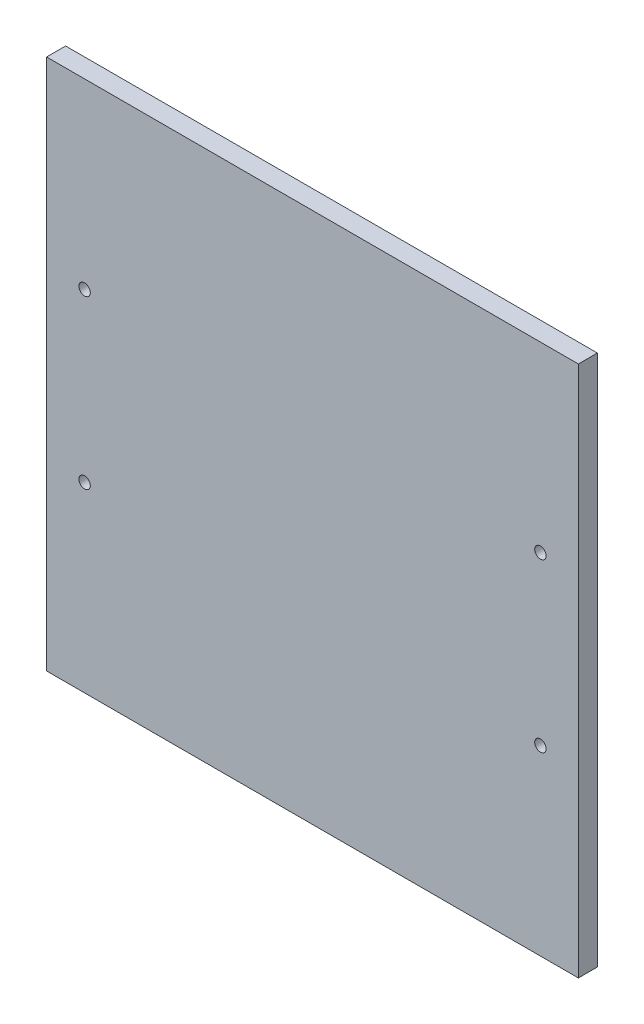
ISO-10303-21;
HEADER;
FILE_DESCRIPTION(('STEP AP214'),'2;1');
FILE_NAME('part.step','',(''),(''),'','','');
FILE_SCHEMA(('AUTOMOTIVE_DESIGN { 1 0 10303 214 1 1 1 1 }'));
ENDSEC;
DATA;
#1=APPLICATION_CONTEXT('core data for automotive mechanical design processes');
#2=APPLICATION_PROTOCOL_DEFINITION('international standard','automotive_design',2000,#1);
#3=PRODUCT_CONTEXT('',#1,'mechanical');
#4=PRODUCT('Part','Part','',(#3));
#5=PRODUCT_RELATED_PRODUCT_CATEGORY('part','',(#4));
#6=PRODUCT_DEFINITION_FORMATION('','',#4);
#7=PRODUCT_DEFINITION_CONTEXT('part definition',#1,'design');
#8=PRODUCT_DEFINITION('design','',#6,#7);
#9=PRODUCT_DEFINITION_SHAPE('','',#8);
#10=(LENGTH_UNIT() NAMED_UNIT(*) SI_UNIT(.MILLI.,.METRE.));
#11=(NAMED_UNIT(*) PLANE_ANGLE_UNIT() SI_UNIT($,.RADIAN.));
#12=(NAMED_UNIT(*) SI_UNIT($,.STERADIAN.) SOLID_ANGLE_UNIT());
#13=UNCERTAINTY_MEASURE_WITH_UNIT(LENGTH_MEASURE(1.E-05),#10,'distance_accuracy_value','');
#14=(GEOMETRIC_REPRESENTATION_CONTEXT(3) GLOBAL_UNCERTAINTY_ASSIGNED_CONTEXT((#13)) GLOBAL_UNIT_ASSIGNED_CONTEXT((#10,
#11,#12)) REPRESENTATION_CONTEXT('',''));
#15=CARTESIAN_POINT('',(0.,0.,0.));
#16=DIRECTION('',(0.,0.,1.));
#17=DIRECTION('',(1.,0.,0.));
#18=AXIS2_PLACEMENT_3D('',#15,#16,#17);
#19=CARTESIAN_POINT('',(0.,0.,5.));
#20=DIRECTION('',(1.,0.,0.));
#21=DIRECTION('',(0.,0.,-1.));
#22=AXIS2_PLACEMENT_3D('',#19,#20,#21);
#23=PLANE('',#22);
#24=DIRECTION('',(0.,-1.,0.));
#25=VECTOR('',#24,1.);
#26=CARTESIAN_POINT('',(0.,0.,0.));
#27=LINE('',#26,#25);
#28=CARTESIAN_POINT('',(0.,140.,0.));
#29=VERTEX_POINT('',#28);
#30=CARTESIAN_POINT('',(0.,0.,0.));
#31=VERTEX_POINT('',#30);
#32=EDGE_CURVE('E94',#29,#31,#27,.T.);
#33=ORIENTED_EDGE('',*,*,#32,.T.);
#34=DIRECTION('',(0.,0.,-1.));
#35=VECTOR('',#34,1.);
#36=CARTESIAN_POINT('',(0.,0.,5.));
#37=LINE('',#36,#35);
#38=CARTESIAN_POINT('',(0.,0.,5.));
#39=VERTEX_POINT('',#38);
#40=EDGE_CURVE('E11',#39,#31,#37,.T.);
#41=ORIENTED_EDGE('',*,*,#40,.F.);
#42=DIRECTION('',(0.,-1.,0.));
#43=VECTOR('',#42,1.);
#44=CARTESIAN_POINT('',(0.,0.,5.));
#45=LINE('',#44,#43);
#46=CARTESIAN_POINT('',(0.,140.,5.));
#47=VERTEX_POINT('',#46);
#48=EDGE_CURVE('E82',#47,#39,#45,.T.);
#49=ORIENTED_EDGE('',*,*,#48,.F.);
#50=DIRECTION('',(0.,0.,-1.));
#51=VECTOR('',#50,1.);
#52=CARTESIAN_POINT('',(0.,140.,5.));
#53=LINE('',#52,#51);
#54=EDGE_CURVE('E90',#47,#29,#53,.T.);
#55=ORIENTED_EDGE('',*,*,#54,.T.);
#56=EDGE_LOOP('',(#33,#41,#49,#55));
#57=FACE_BOUND('',#56,.T.);
#58=ADVANCED_FACE('F31',(#57),#23,.F.);
#59=CARTESIAN_POINT('',(0.,0.,5.));
#60=DIRECTION('',(0.,1.,0.));
#61=DIRECTION('',(-1.,0.,0.));
#62=AXIS2_PLACEMENT_3D('',#59,#60,#61);
#63=PLANE('',#62);
#64=DIRECTION('',(1.,0.,0.));
#65=VECTOR('',#64,1.);
#66=CARTESIAN_POINT('',(0.,0.,0.));
#67=LINE('',#66,#65);
#68=CARTESIAN_POINT('',(140.,0.,0.));
#69=VERTEX_POINT('',#68);
#70=EDGE_CURVE('E86',#31,#69,#67,.T.);
#71=ORIENTED_EDGE('',*,*,#70,.T.);
#72=DIRECTION('',(0.,0.,-1.));
#73=VECTOR('',#72,1.);
#74=CARTESIAN_POINT('',(140.,0.,5.));
#75=LINE('',#74,#73);
#76=CARTESIAN_POINT('',(140.,0.,5.));
#77=VERTEX_POINT('',#76);
#78=EDGE_CURVE('E39',#77,#69,#75,.T.);
#79=ORIENTED_EDGE('',*,*,#78,.F.);
#80=DIRECTION('',(1.,0.,0.));
#81=VECTOR('',#80,1.);
#82=CARTESIAN_POINT('',(0.,0.,5.));
#83=LINE('',#82,#81);
#84=EDGE_CURVE('E77',#39,#77,#83,.T.);
#85=ORIENTED_EDGE('',*,*,#84,.F.);
#86=ORIENTED_EDGE('',*,*,#40,.T.);
#87=EDGE_LOOP('',(#71,#79,#85,#86));
#88=FACE_BOUND('',#87,.T.);
#89=ADVANCED_FACE('F85',(#88),#63,.F.);
#90=CARTESIAN_POINT('',(140.,0.,5.));
#91=DIRECTION('',(-1.,0.,0.));
#92=DIRECTION('',(0.,-1.,0.));
#93=AXIS2_PLACEMENT_3D('',#90,#91,#92);
#94=PLANE('',#93);
#95=DIRECTION('',(0.,1.,0.));
#96=VECTOR('',#95,1.);
#97=CARTESIAN_POINT('',(140.,0.,0.));
#98=LINE('',#97,#96);
#99=CARTESIAN_POINT('',(140.,140.,0.));
#100=VERTEX_POINT('',#99);
#101=EDGE_CURVE('E64',#69,#100,#98,.T.);
#102=ORIENTED_EDGE('',*,*,#101,.T.);
#103=DIRECTION('',(0.,0.,-1.));
#104=VECTOR('',#103,1.);
#105=CARTESIAN_POINT('',(140.,140.,5.));
#106=LINE('',#105,#104);
#107=CARTESIAN_POINT('',(140.,140.,5.));
#108=VERTEX_POINT('',#107);
#109=EDGE_CURVE('E87',#108,#100,#106,.T.);
#110=ORIENTED_EDGE('',*,*,#109,.F.);
#111=DIRECTION('',(0.,1.,0.));
#112=VECTOR('',#111,1.);
#113=CARTESIAN_POINT('',(140.,0.,5.));
#114=LINE('',#113,#112);
#115=EDGE_CURVE('E80',#77,#108,#114,.T.);
#116=ORIENTED_EDGE('',*,*,#115,.F.);
#117=ORIENTED_EDGE('',*,*,#78,.T.);
#118=EDGE_LOOP('',(#102,#110,#116,#117));
#119=FACE_BOUND('',#118,.T.);
#120=ADVANCED_FACE('F88',(#119),#94,.F.);
#121=CARTESIAN_POINT('',(0.,140.,5.));
#122=DIRECTION('',(0.,-1.,0.));
#123=DIRECTION('',(0.,0.,-1.));
#124=AXIS2_PLACEMENT_3D('',#121,#122,#123);
#125=PLANE('',#124);
#126=DIRECTION('',(-1.,0.,0.));
#127=VECTOR('',#126,1.);
#128=CARTESIAN_POINT('',(0.,140.,0.));
#129=LINE('',#128,#127);
#130=EDGE_CURVE('E70',#100,#29,#129,.T.);
#131=ORIENTED_EDGE('',*,*,#130,.T.);
#132=ORIENTED_EDGE('',*,*,#54,.F.);
#133=DIRECTION('',(-1.,0.,0.));
#134=VECTOR('',#133,1.);
#135=CARTESIAN_POINT('',(0.,140.,5.));
#136=LINE('',#135,#134);
#137=EDGE_CURVE('E47',#108,#47,#136,.T.);
#138=ORIENTED_EDGE('',*,*,#137,.F.);
#139=ORIENTED_EDGE('',*,*,#109,.T.);
#140=EDGE_LOOP('',(#131,#132,#138,#139));
#141=FACE_BOUND('',#140,.T.);
#142=ADVANCED_FACE('F102',(#141),#125,.F.);
#143=CARTESIAN_POINT('',(0.,140.,5.));
#144=DIRECTION('',(0.,0.,-1.));
#145=DIRECTION('',(-1.,0.,0.));
#146=AXIS2_PLACEMENT_3D('',#143,#144,#145);
#147=PLANE('',#146);
#148=CARTESIAN_POINT('',(130.,92.,5.));
#149=DIRECTION('',(0.,0.,-1.));
#150=DIRECTION('',(-1.,0.,0.));
#151=AXIS2_PLACEMENT_3D('',#148,#149,#150);
#152=CIRCLE('',#151,1.5);
#153=CARTESIAN_POINT('',(128.5,92.,5.));
#154=VERTEX_POINT('',#153);
#155=EDGE_CURVE('E134',#154,#154,#152,.T.);
#156=ORIENTED_EDGE('',*,*,#155,.T.);
#157=EDGE_LOOP('',(#156));
#158=FACE_BOUND('',#157,.T.);
#159=CARTESIAN_POINT('',(130.,48.,5.));
#160=DIRECTION('',(0.,0.,-1.));
#161=DIRECTION('',(-1.,0.,0.));
#162=AXIS2_PLACEMENT_3D('',#159,#160,#161);
#163=CIRCLE('',#162,1.5);
#164=CARTESIAN_POINT('',(128.5,48.,5.));
#165=VERTEX_POINT('',#164);
#166=EDGE_CURVE('E125',#165,#165,#163,.T.);
#167=ORIENTED_EDGE('',*,*,#166,.T.);
#168=EDGE_LOOP('',(#167));
#169=FACE_BOUND('',#168,.T.);
#170=CARTESIAN_POINT('',(10.,92.,5.));
#171=DIRECTION('',(0.,0.,-1.));
#172=DIRECTION('',(-1.,0.,0.));
#173=AXIS2_PLACEMENT_3D('',#170,#171,#172);
#174=CIRCLE('',#173,1.5);
#175=CARTESIAN_POINT('',(8.50000000000005,92.,5.));
#176=VERTEX_POINT('',#175);
#177=EDGE_CURVE('E116',#176,#176,#174,.T.);
#178=ORIENTED_EDGE('',*,*,#177,.T.);
#179=EDGE_LOOP('',(#178));
#180=FACE_BOUND('',#179,.T.);
#181=CARTESIAN_POINT('',(10.,48.,5.));
#182=DIRECTION('',(0.,0.,-1.));
#183=DIRECTION('',(-1.,0.,0.));
#184=AXIS2_PLACEMENT_3D('',#181,#182,#183);
#185=CIRCLE('',#184,1.5);
#186=CARTESIAN_POINT('',(8.50000000000004,48.,5.));
#187=VERTEX_POINT('',#186);
#188=EDGE_CURVE('E97',#187,#187,#185,.T.);
#189=ORIENTED_EDGE('',*,*,#188,.T.);
#190=EDGE_LOOP('',(#189));
#191=FACE_BOUND('',#190,.T.);
#192=ORIENTED_EDGE('',*,*,#48,.T.);
#193=ORIENTED_EDGE('',*,*,#84,.T.);
#194=ORIENTED_EDGE('',*,*,#115,.T.);
#195=ORIENTED_EDGE('',*,*,#137,.T.);
#196=EDGE_LOOP('',(#192,#193,#194,#195));
#197=FACE_BOUND('',#196,.T.);
#198=ADVANCED_FACE('F78',(#158,#169,#180,#191,#197),#147,.F.);
#199=CARTESIAN_POINT('',(0.,140.,0.));
#200=DIRECTION('',(0.,0.,-1.));
#201=DIRECTION('',(-1.,0.,0.));
#202=AXIS2_PLACEMENT_3D('',#199,#200,#201);
#203=PLANE('',#202);
#204=CARTESIAN_POINT('',(130.,92.,0.));
#205=DIRECTION('',(0.,0.,-1.));
#206=DIRECTION('',(-1.,0.,0.));
#207=AXIS2_PLACEMENT_3D('',#204,#205,#206);
#208=CIRCLE('',#207,4.);
#209=CARTESIAN_POINT('',(126.,92.,0.));
#210=VERTEX_POINT('',#209);
#211=EDGE_CURVE('E140',#210,#210,#208,.T.);
#212=ORIENTED_EDGE('',*,*,#211,.F.);
#213=EDGE_LOOP('',(#212));
#214=FACE_BOUND('',#213,.T.);
#215=CARTESIAN_POINT('',(130.,48.,0.));
#216=DIRECTION('',(0.,0.,-1.));
#217=DIRECTION('',(-1.,0.,0.));
#218=AXIS2_PLACEMENT_3D('',#215,#216,#217);
#219=CIRCLE('',#218,4.);
#220=CARTESIAN_POINT('',(126.,48.,0.));
#221=VERTEX_POINT('',#220);
#222=EDGE_CURVE('E131',#221,#221,#219,.T.);
#223=ORIENTED_EDGE('',*,*,#222,.F.);
#224=EDGE_LOOP('',(#223));
#225=FACE_BOUND('',#224,.T.);
#226=CARTESIAN_POINT('',(10.,92.,0.));
#227=DIRECTION('',(0.,0.,-1.));
#228=DIRECTION('',(-1.,0.,0.));
#229=AXIS2_PLACEMENT_3D('',#226,#227,#228);
#230=CIRCLE('',#229,4.);
#231=CARTESIAN_POINT('',(6.00000000000005,92.,0.));
#232=VERTEX_POINT('',#231);
#233=EDGE_CURVE('E122',#232,#232,#230,.T.);
#234=ORIENTED_EDGE('',*,*,#233,.F.);
#235=EDGE_LOOP('',(#234));
#236=FACE_BOUND('',#235,.T.);
#237=CARTESIAN_POINT('',(10.,48.,0.));
#238=DIRECTION('',(0.,0.,-1.));
#239=DIRECTION('',(-1.,0.,0.));
#240=AXIS2_PLACEMENT_3D('',#237,#238,#239);
#241=CIRCLE('',#240,4.);
#242=CARTESIAN_POINT('',(6.00000000000004,48.,0.));
#243=VERTEX_POINT('',#242);
#244=EDGE_CURVE('E113',#243,#243,#241,.T.);
#245=ORIENTED_EDGE('',*,*,#244,.F.);
#246=EDGE_LOOP('',(#245));
#247=FACE_BOUND('',#246,.T.);
#248=ORIENTED_EDGE('',*,*,#32,.F.);
#249=ORIENTED_EDGE('',*,*,#130,.F.);
#250=ORIENTED_EDGE('',*,*,#101,.F.);
#251=ORIENTED_EDGE('',*,*,#70,.F.);
#252=EDGE_LOOP('',(#248,#249,#250,#251));
#253=FACE_BOUND('',#252,.T.);
#254=ADVANCED_FACE('F105',(#214,#225,#236,#247,#253),#203,.T.);
#255=CARTESIAN_POINT('',(10.,48.,0.));
#256=DIRECTION('',(0.,0.,-1.));
#257=DIRECTION('',(-1.,0.,0.));
#258=AXIS2_PLACEMENT_3D('',#255,#256,#257);
#259=CYLINDRICAL_SURFACE('',#258,1.5);
#260=ORIENTED_EDGE('',*,*,#188,.F.);
#261=EDGE_LOOP('',(#260));
#262=FACE_BOUND('',#261,.T.);
#263=CARTESIAN_POINT('',(10.,48.,2.5));
#264=DIRECTION('',(0.,0.,-1.));
#265=DIRECTION('',(-1.,0.,0.));
#266=AXIS2_PLACEMENT_3D('',#263,#264,#265);
#267=CIRCLE('',#266,1.5);
#268=CARTESIAN_POINT('',(8.50000000000004,48.,2.5));
#269=VERTEX_POINT('',#268);
#270=EDGE_CURVE('E110',#269,#269,#267,.T.);
#271=ORIENTED_EDGE('',*,*,#270,.T.);
#272=EDGE_LOOP('',(#271));
#273=FACE_BOUND('',#272,.T.);
#274=ADVANCED_FACE('F148',(#262,#273),#259,.F.);
#275=CARTESIAN_POINT('',(10.,48.,0.));
#276=DIRECTION('',(0.,0.,-1.));
#277=DIRECTION('',(-1.,0.,0.));
#278=AXIS2_PLACEMENT_3D('',#275,#276,#277);
#279=CONICAL_SURFACE('',#278,4.,0.785398163397448);
#280=ORIENTED_EDGE('',*,*,#270,.F.);
#281=EDGE_LOOP('',(#280));
#282=FACE_BOUND('',#281,.T.);
#283=ORIENTED_EDGE('',*,*,#244,.T.);
#284=EDGE_LOOP('',(#283));
#285=FACE_BOUND('',#284,.T.);
#286=ADVANCED_FACE('F156',(#282,#285),#279,.F.);
#287=CARTESIAN_POINT('',(10.,92.,0.));
#288=DIRECTION('',(0.,0.,-1.));
#289=DIRECTION('',(-1.,0.,0.));
#290=AXIS2_PLACEMENT_3D('',#287,#288,#289);
#291=CYLINDRICAL_SURFACE('',#290,1.5);
#292=ORIENTED_EDGE('',*,*,#177,.F.);
#293=EDGE_LOOP('',(#292));
#294=FACE_BOUND('',#293,.T.);
#295=CARTESIAN_POINT('',(10.,92.,2.5));
#296=DIRECTION('',(0.,0.,-1.));
#297=DIRECTION('',(-1.,0.,0.));
#298=AXIS2_PLACEMENT_3D('',#295,#296,#297);
#299=CIRCLE('',#298,1.5);
#300=CARTESIAN_POINT('',(8.50000000000005,92.,2.5));
#301=VERTEX_POINT('',#300);
#302=EDGE_CURVE('E119',#301,#301,#299,.T.);
#303=ORIENTED_EDGE('',*,*,#302,.T.);
#304=EDGE_LOOP('',(#303));
#305=FACE_BOUND('',#304,.T.);
#306=ADVANCED_FACE('F158',(#294,#305),#291,.F.);
#307=CARTESIAN_POINT('',(10.,92.,0.));
#308=DIRECTION('',(0.,0.,-1.));
#309=DIRECTION('',(-1.,0.,0.));
#310=AXIS2_PLACEMENT_3D('',#307,#308,#309);
#311=CONICAL_SURFACE('',#310,4.,0.785398163397448);
#312=ORIENTED_EDGE('',*,*,#302,.F.);
#313=EDGE_LOOP('',(#312));
#314=FACE_BOUND('',#313,.T.);
#315=ORIENTED_EDGE('',*,*,#233,.T.);
#316=EDGE_LOOP('',(#315));
#317=FACE_BOUND('',#316,.T.);
#318=ADVANCED_FACE('F165',(#314,#317),#311,.F.);
#319=CARTESIAN_POINT('',(130.,48.,0.));
#320=DIRECTION('',(0.,0.,-1.));
#321=DIRECTION('',(-1.,0.,0.));
#322=AXIS2_PLACEMENT_3D('',#319,#320,#321);
#323=CYLINDRICAL_SURFACE('',#322,1.5);
#324=ORIENTED_EDGE('',*,*,#166,.F.);
#325=EDGE_LOOP('',(#324));
#326=FACE_BOUND('',#325,.T.);
#327=CARTESIAN_POINT('',(130.,48.,2.5));
#328=DIRECTION('',(0.,0.,-1.));
#329=DIRECTION('',(-1.,0.,0.));
#330=AXIS2_PLACEMENT_3D('',#327,#328,#329);
#331=CIRCLE('',#330,1.5);
#332=CARTESIAN_POINT('',(128.5,48.,2.5));
#333=VERTEX_POINT('',#332);
#334=EDGE_CURVE('E128',#333,#333,#331,.T.);
#335=ORIENTED_EDGE('',*,*,#334,.T.);
#336=EDGE_LOOP('',(#335));
#337=FACE_BOUND('',#336,.T.);
#338=ADVANCED_FACE('F199',(#326,#337),#323,.F.);
#339=CARTESIAN_POINT('',(130.,48.,0.));
#340=DIRECTION('',(0.,0.,-1.));
#341=DIRECTION('',(-1.,0.,0.));
#342=AXIS2_PLACEMENT_3D('',#339,#340,#341);
#343=CONICAL_SURFACE('',#342,4.,0.785398163397449);
#344=ORIENTED_EDGE('',*,*,#334,.F.);
#345=EDGE_LOOP('',(#344));
#346=FACE_BOUND('',#345,.T.);
#347=ORIENTED_EDGE('',*,*,#222,.T.);
#348=EDGE_LOOP('',(#347));
#349=FACE_BOUND('',#348,.T.);
#350=ADVANCED_FACE('F204',(#346,#349),#343,.F.);
#351=CARTESIAN_POINT('',(130.,92.,0.));
#352=DIRECTION('',(0.,0.,-1.));
#353=DIRECTION('',(-1.,0.,0.));
#354=AXIS2_PLACEMENT_3D('',#351,#352,#353);
#355=CYLINDRICAL_SURFACE('',#354,1.5);
#356=ORIENTED_EDGE('',*,*,#155,.F.);
#357=EDGE_LOOP('',(#356));
#358=FACE_BOUND('',#357,.T.);
#359=CARTESIAN_POINT('',(130.,92.,2.5));
#360=DIRECTION('',(0.,0.,-1.));
#361=DIRECTION('',(-1.,0.,0.));
#362=AXIS2_PLACEMENT_3D('',#359,#360,#361);
#363=CIRCLE('',#362,1.5);
#364=CARTESIAN_POINT('',(128.5,92.,2.5));
#365=VERTEX_POINT('',#364);
#366=EDGE_CURVE('E137',#365,#365,#363,.T.);
#367=ORIENTED_EDGE('',*,*,#366,.T.);
#368=EDGE_LOOP('',(#367));
#369=FACE_BOUND('',#368,.T.);
#370=ADVANCED_FACE('F210',(#358,#369),#355,.F.);
#371=CARTESIAN_POINT('',(130.,92.,0.));
#372=DIRECTION('',(0.,0.,-1.));
#373=DIRECTION('',(-1.,0.,0.));
#374=AXIS2_PLACEMENT_3D('',#371,#372,#373);
#375=CONICAL_SURFACE('',#374,4.,0.785398163397449);
#376=ORIENTED_EDGE('',*,*,#366,.F.);
#377=EDGE_LOOP('',(#376));
#378=FACE_BOUND('',#377,.T.);
#379=ORIENTED_EDGE('',*,*,#211,.T.);
#380=EDGE_LOOP('',(#379));
#381=FACE_BOUND('',#380,.T.);
#382=ADVANCED_FACE('F144',(#378,#381),#375,.F.);
#383=CLOSED_SHELL('',(#58,#89,#120,#142,#198,#254,#274,#286,#306,#318,#338,#350,#370,#382));
#384=MANIFOLD_SOLID_BREP('B2',#383);
#385=ADVANCED_BREP_SHAPE_REPRESENTATION('',(#18,#384),#14);
#386=SHAPE_DEFINITION_REPRESENTATION(#9,#385);
ENDSEC;
END-ISO-10303-21;
